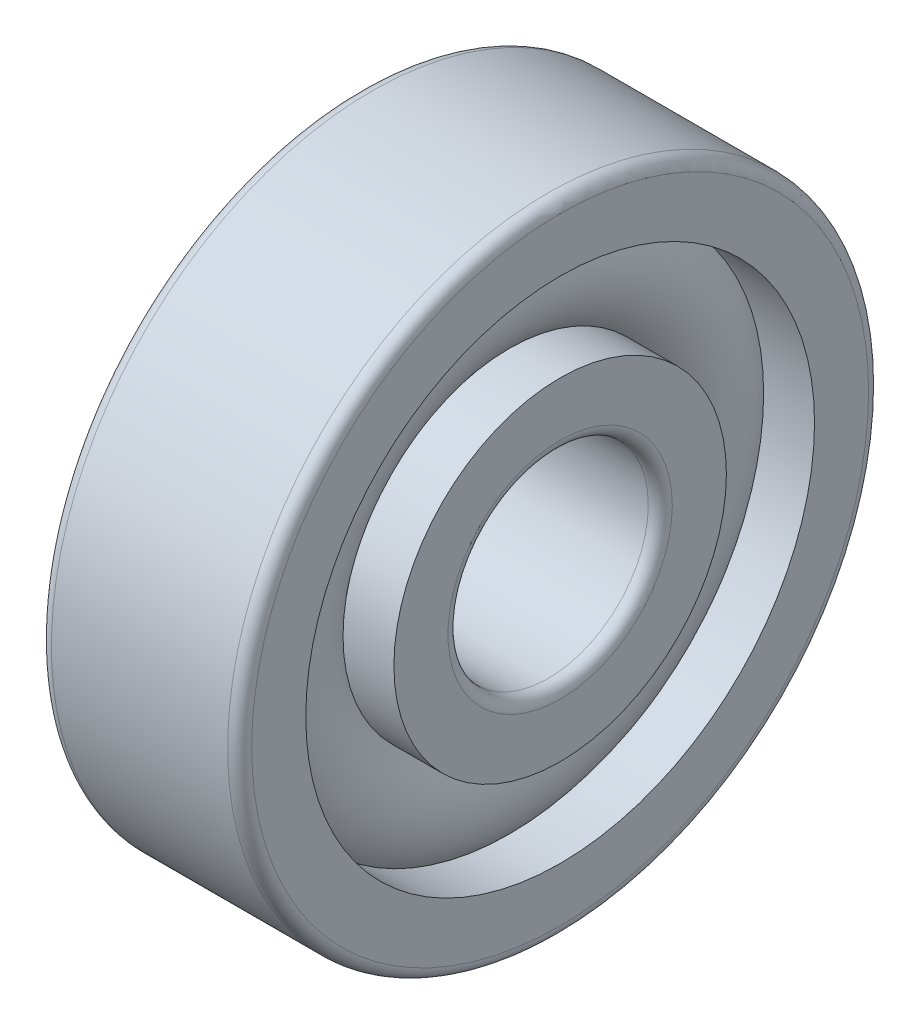
ISO-10303-21;
HEADER;
FILE_DESCRIPTION(('STEP AP214'),'2;1');
FILE_NAME('part.step','',(''),(''),'','','');
FILE_SCHEMA(('AUTOMOTIVE_DESIGN { 1 0 10303 214 1 1 1 1 }'));
ENDSEC;
DATA;
#1=APPLICATION_CONTEXT('core data for automotive mechanical design processes');
#2=APPLICATION_PROTOCOL_DEFINITION('international standard','automotive_design',2000,#1);
#3=PRODUCT_CONTEXT('',#1,'mechanical');
#4=PRODUCT('Part','Part','',(#3));
#5=PRODUCT_RELATED_PRODUCT_CATEGORY('part','',(#4));
#6=PRODUCT_DEFINITION_FORMATION('','',#4);
#7=PRODUCT_DEFINITION_CONTEXT('part definition',#1,'design');
#8=PRODUCT_DEFINITION('design','',#6,#7);
#9=PRODUCT_DEFINITION_SHAPE('','',#8);
#10=(LENGTH_UNIT() NAMED_UNIT(*) SI_UNIT(.MILLI.,.METRE.));
#11=(NAMED_UNIT(*) PLANE_ANGLE_UNIT() SI_UNIT($,.RADIAN.));
#12=(NAMED_UNIT(*) SI_UNIT($,.STERADIAN.) SOLID_ANGLE_UNIT());
#13=UNCERTAINTY_MEASURE_WITH_UNIT(LENGTH_MEASURE(1.E-05),#10,'distance_accuracy_value','');
#14=(GEOMETRIC_REPRESENTATION_CONTEXT(3) GLOBAL_UNCERTAINTY_ASSIGNED_CONTEXT((#13)) GLOBAL_UNIT_ASSIGNED_CONTEXT((#10,
#11,#12)) REPRESENTATION_CONTEXT('',''));
#15=CARTESIAN_POINT('',(0.,0.,0.));
#16=DIRECTION('',(0.,0.,1.));
#17=DIRECTION('',(1.,0.,0.));
#18=AXIS2_PLACEMENT_3D('',#15,#16,#17);
#19=CARTESIAN_POINT('',(0.,0.,0.));
#20=DIRECTION('',(-1.,0.,0.));
#21=DIRECTION('',(0.,0.,1.));
#22=AXIS2_PLACEMENT_3D('',#19,#20,#21);
#23=TOROIDAL_SURFACE('',#22,5.25,1.65);
#24=CARTESIAN_POINT('',(1.22983738762488,0.,0.));
#25=DIRECTION('',(-1.,0.,0.));
#26=DIRECTION('',(0.,0.,1.));
#27=AXIS2_PLACEMENT_3D('',#24,#25,#26);
#28=CIRCLE('',#27,6.35);
#29=CARTESIAN_POINT('',(1.22983738762488,0.,6.35));
#30=VERTEX_POINT('',#29);
#31=EDGE_CURVE('E35',#30,#30,#28,.F.);
#32=ORIENTED_EDGE('',*,*,#31,.T.);
#33=EDGE_LOOP('',(#32));
#34=FACE_BOUND('',#33,.T.);
#35=CARTESIAN_POINT('',(1.22983738762488,0.,0.));
#36=DIRECTION('',(-1.,0.,0.));
#37=DIRECTION('',(0.,0.,1.));
#38=AXIS2_PLACEMENT_3D('',#35,#36,#37);
#39=CIRCLE('',#38,4.15);
#40=CARTESIAN_POINT('',(1.22983738762488,0.,4.15));
#41=VERTEX_POINT('',#40);
#42=EDGE_CURVE('E10',#41,#41,#39,.T.);
#43=ORIENTED_EDGE('',*,*,#42,.T.);
#44=EDGE_LOOP('',(#43));
#45=FACE_BOUND('',#44,.T.);
#46=ADVANCED_FACE('F31',(#34,#45),#23,.T.);
#47=CARTESIAN_POINT('',(-20.6375,0.,0.));
#48=DIRECTION('',(1.,0.,0.));
#49=DIRECTION('',(0.,0.,-1.));
#50=AXIS2_PLACEMENT_3D('',#47,#48,#49);
#51=CYLINDRICAL_SURFACE('',#50,4.15);
#52=CARTESIAN_POINT('',(2.5,0.,0.));
#53=DIRECTION('',(1.,0.,0.));
#54=DIRECTION('',(0.,0.,-1.));
#55=AXIS2_PLACEMENT_3D('',#52,#53,#54);
#56=CIRCLE('',#55,4.15);
#57=CARTESIAN_POINT('',(2.5,0.,-4.15));
#58=VERTEX_POINT('',#57);
#59=EDGE_CURVE('E44',#58,#58,#56,.T.);
#60=ORIENTED_EDGE('',*,*,#59,.F.);
#61=EDGE_LOOP('',(#60));
#62=FACE_BOUND('',#61,.T.);
#63=ORIENTED_EDGE('',*,*,#42,.F.);
#64=EDGE_LOOP('',(#63));
#65=FACE_BOUND('',#64,.T.);
#66=ADVANCED_FACE('F83',(#62,#65),#51,.T.);
#67=CARTESIAN_POINT('',(-20.6375,0.,0.));
#68=DIRECTION('',(1.,0.,0.));
#69=DIRECTION('',(0.,0.,-1.));
#70=AXIS2_PLACEMENT_3D('',#67,#68,#69);
#71=CYLINDRICAL_SURFACE('',#70,4.15);
#72=CARTESIAN_POINT('',(-2.5,0.,0.));
#73=DIRECTION('',(1.,0.,0.));
#74=DIRECTION('',(0.,0.,-1.));
#75=AXIS2_PLACEMENT_3D('',#72,#73,#74);
#76=CIRCLE('',#75,4.15);
#77=CARTESIAN_POINT('',(-2.5,0.,-4.15));
#78=VERTEX_POINT('',#77);
#79=EDGE_CURVE('E53',#78,#78,#76,.T.);
#80=ORIENTED_EDGE('',*,*,#79,.T.);
#81=EDGE_LOOP('',(#80));
#82=FACE_BOUND('',#81,.T.);
#83=CARTESIAN_POINT('',(-1.22983738762488,0.,0.));
#84=DIRECTION('',(1.,0.,0.));
#85=DIRECTION('',(0.,0.,-1.));
#86=AXIS2_PLACEMENT_3D('',#83,#84,#85);
#87=CIRCLE('',#86,4.15);
#88=CARTESIAN_POINT('',(-1.22983738762488,0.,-4.15));
#89=VERTEX_POINT('',#88);
#90=EDGE_CURVE('E39',#89,#89,#87,.T.);
#91=ORIENTED_EDGE('',*,*,#90,.F.);
#92=EDGE_LOOP('',(#91));
#93=FACE_BOUND('',#92,.T.);
#94=ADVANCED_FACE('F86',(#82,#93),#71,.T.);
#95=CARTESIAN_POINT('',(2.5,2.8,0.));
#96=DIRECTION('',(1.,0.,0.));
#97=DIRECTION('',(0.,0.,-1.));
#98=AXIS2_PLACEMENT_3D('',#95,#96,#97);
#99=PLANE('',#98);
#100=ORIENTED_EDGE('',*,*,#59,.T.);
#101=EDGE_LOOP('',(#100));
#102=FACE_BOUND('',#101,.T.);
#103=CARTESIAN_POINT('',(2.5,0.,0.));
#104=DIRECTION('',(1.,0.,0.));
#105=DIRECTION('',(0.,0.,-1.));
#106=AXIS2_PLACEMENT_3D('',#103,#104,#105);
#107=CIRCLE('',#106,2.8);
#108=CARTESIAN_POINT('',(2.5,0.,-2.8));
#109=VERTEX_POINT('',#108);
#110=EDGE_CURVE('E75',#109,#109,#107,.T.);
#111=ORIENTED_EDGE('',*,*,#110,.F.);
#112=EDGE_LOOP('',(#111));
#113=FACE_BOUND('',#112,.T.);
#114=ADVANCED_FACE('F80',(#102,#113),#99,.T.);
#115=CARTESIAN_POINT('',(2.2,0.,0.));
#116=DIRECTION('',(1.,0.,0.));
#117=DIRECTION('',(0.,0.,-1.));
#118=AXIS2_PLACEMENT_3D('',#115,#116,#117);
#119=TOROIDAL_SURFACE('',#118,2.8,0.3);
#120=ORIENTED_EDGE('',*,*,#110,.T.);
#121=EDGE_LOOP('',(#120));
#122=FACE_BOUND('',#121,.T.);
#123=CARTESIAN_POINT('',(2.2,0.,0.));
#124=DIRECTION('',(1.,0.,0.));
#125=DIRECTION('',(0.,0.,-1.));
#126=AXIS2_PLACEMENT_3D('',#123,#124,#125);
#127=CIRCLE('',#126,2.5);
#128=CARTESIAN_POINT('',(2.2,0.,-2.5));
#129=VERTEX_POINT('',#128);
#130=EDGE_CURVE('E72',#129,#129,#127,.T.);
#131=ORIENTED_EDGE('',*,*,#130,.F.);
#132=EDGE_LOOP('',(#131));
#133=FACE_BOUND('',#132,.T.);
#134=ADVANCED_FACE('F97',(#122,#133),#119,.T.);
#135=CARTESIAN_POINT('',(-20.6375,0.,0.));
#136=DIRECTION('',(1.,0.,0.));
#137=DIRECTION('',(0.,0.,-1.));
#138=AXIS2_PLACEMENT_3D('',#135,#136,#137);
#139=CYLINDRICAL_SURFACE('',#138,2.5);
#140=ORIENTED_EDGE('',*,*,#130,.T.);
#141=EDGE_LOOP('',(#140));
#142=FACE_BOUND('',#141,.T.);
#143=CARTESIAN_POINT('',(-2.2,0.,0.));
#144=DIRECTION('',(1.,0.,0.));
#145=DIRECTION('',(0.,0.,-1.));
#146=AXIS2_PLACEMENT_3D('',#143,#144,#145);
#147=CIRCLE('',#146,2.5);
#148=CARTESIAN_POINT('',(-2.2,0.,-2.5));
#149=VERTEX_POINT('',#148);
#150=EDGE_CURVE('E69',#149,#149,#147,.T.);
#151=ORIENTED_EDGE('',*,*,#150,.F.);
#152=EDGE_LOOP('',(#151));
#153=FACE_BOUND('',#152,.T.);
#154=ADVANCED_FACE('F100',(#142,#153),#139,.F.);
#155=CARTESIAN_POINT('',(-2.2,0.,0.));
#156=DIRECTION('',(1.,0.,0.));
#157=DIRECTION('',(0.,0.,-1.));
#158=AXIS2_PLACEMENT_3D('',#155,#156,#157);
#159=TOROIDAL_SURFACE('',#158,2.8,0.3);
#160=ORIENTED_EDGE('',*,*,#150,.T.);
#161=EDGE_LOOP('',(#160));
#162=FACE_BOUND('',#161,.T.);
#163=CARTESIAN_POINT('',(-2.5,0.,0.));
#164=DIRECTION('',(1.,0.,0.));
#165=DIRECTION('',(0.,0.,-1.));
#166=AXIS2_PLACEMENT_3D('',#163,#164,#165);
#167=CIRCLE('',#166,2.8);
#168=CARTESIAN_POINT('',(-2.5,0.,-2.8));
#169=VERTEX_POINT('',#168);
#170=EDGE_CURVE('E66',#169,#169,#167,.T.);
#171=ORIENTED_EDGE('',*,*,#170,.F.);
#172=EDGE_LOOP('',(#171));
#173=FACE_BOUND('',#172,.T.);
#174=ADVANCED_FACE('F104',(#162,#173),#159,.T.);
#175=CARTESIAN_POINT('',(-2.5,4.15,0.));
#176=DIRECTION('',(-1.,0.,0.));
#177=DIRECTION('',(0.,0.,1.));
#178=AXIS2_PLACEMENT_3D('',#175,#176,#177);
#179=PLANE('',#178);
#180=ORIENTED_EDGE('',*,*,#170,.T.);
#181=EDGE_LOOP('',(#180));
#182=FACE_BOUND('',#181,.T.);
#183=ORIENTED_EDGE('',*,*,#79,.F.);
#184=EDGE_LOOP('',(#183));
#185=FACE_BOUND('',#184,.T.);
#186=ADVANCED_FACE('F108',(#182,#185),#179,.T.);
#187=CARTESIAN_POINT('',(-1.22983738762488,0.,0.));
#188=DIRECTION('',(1.,0.,0.));
#189=DIRECTION('',(0.,0.,-1.));
#190=AXIS2_PLACEMENT_3D('',#187,#188,#189);
#191=CIRCLE('',#190,6.35);
#192=CARTESIAN_POINT('',(-1.22983738762488,0.,-6.35));
#193=VERTEX_POINT('',#192);
#194=EDGE_CURVE('E47',#193,#193,#191,.F.);
#195=ORIENTED_EDGE('',*,*,#194,.T.);
#196=EDGE_LOOP('',(#195));
#197=FACE_BOUND('',#196,.T.);
#198=ORIENTED_EDGE('',*,*,#90,.T.);
#199=EDGE_LOOP('',(#198));
#200=FACE_BOUND('',#199,.T.);
#201=ADVANCED_FACE('F33',(#197,#200),#23,.T.);
#202=CARTESIAN_POINT('',(-20.6375,0.,0.));
#203=DIRECTION('',(1.,0.,0.));
#204=DIRECTION('',(0.,0.,-1.));
#205=AXIS2_PLACEMENT_3D('',#202,#203,#204);
#206=CYLINDRICAL_SURFACE('',#205,6.35);
#207=CARTESIAN_POINT('',(2.5,0.,0.));
#208=DIRECTION('',(1.,0.,0.));
#209=DIRECTION('',(0.,0.,-1.));
#210=AXIS2_PLACEMENT_3D('',#207,#208,#209);
#211=CIRCLE('',#210,6.35);
#212=CARTESIAN_POINT('',(2.5,0.,-6.35));
#213=VERTEX_POINT('',#212);
#214=EDGE_CURVE('E49',#213,#213,#211,.T.);
#215=ORIENTED_EDGE('',*,*,#214,.T.);
#216=EDGE_LOOP('',(#215));
#217=FACE_BOUND('',#216,.T.);
#218=ORIENTED_EDGE('',*,*,#31,.F.);
#219=EDGE_LOOP('',(#218));
#220=FACE_BOUND('',#219,.T.);
#221=ADVANCED_FACE('F113',(#217,#220),#206,.F.);
#222=CARTESIAN_POINT('',(-20.6375,0.,0.));
#223=DIRECTION('',(1.,0.,0.));
#224=DIRECTION('',(0.,0.,-1.));
#225=AXIS2_PLACEMENT_3D('',#222,#223,#224);
#226=CYLINDRICAL_SURFACE('',#225,6.35);
#227=CARTESIAN_POINT('',(-2.5,0.,0.));
#228=DIRECTION('',(1.,0.,0.));
#229=DIRECTION('',(0.,0.,-1.));
#230=AXIS2_PLACEMENT_3D('',#227,#228,#229);
#231=CIRCLE('',#230,6.35);
#232=CARTESIAN_POINT('',(-2.5,0.,-6.35));
#233=VERTEX_POINT('',#232);
#234=EDGE_CURVE('E144',#233,#233,#231,.T.);
#235=ORIENTED_EDGE('',*,*,#234,.F.);
#236=EDGE_LOOP('',(#235));
#237=FACE_BOUND('',#236,.T.);
#238=ORIENTED_EDGE('',*,*,#194,.F.);
#239=EDGE_LOOP('',(#238));
#240=FACE_BOUND('',#239,.T.);
#241=ADVANCED_FACE('F116',(#237,#240),#226,.F.);
#242=CARTESIAN_POINT('',(2.5,7.70000000000001,0.));
#243=DIRECTION('',(1.,0.,0.));
#244=DIRECTION('',(0.,0.,-1.));
#245=AXIS2_PLACEMENT_3D('',#242,#243,#244);
#246=PLANE('',#245);
#247=CARTESIAN_POINT('',(2.5,0.,0.));
#248=DIRECTION('',(1.,0.,0.));
#249=DIRECTION('',(0.,0.,-1.));
#250=AXIS2_PLACEMENT_3D('',#247,#248,#249);
#251=CIRCLE('',#250,7.70000000000001);
#252=CARTESIAN_POINT('',(2.5,0.,-7.70000000000001));
#253=VERTEX_POINT('',#252);
#254=EDGE_CURVE('E55',#253,#253,#251,.T.);
#255=ORIENTED_EDGE('',*,*,#254,.T.);
#256=EDGE_LOOP('',(#255));
#257=FACE_BOUND('',#256,.T.);
#258=ORIENTED_EDGE('',*,*,#214,.F.);
#259=EDGE_LOOP('',(#258));
#260=FACE_BOUND('',#259,.T.);
#261=ADVANCED_FACE('F117',(#257,#260),#246,.T.);
#262=CARTESIAN_POINT('',(2.2,0.,0.));
#263=DIRECTION('',(1.,0.,0.));
#264=DIRECTION('',(0.,0.,-1.));
#265=AXIS2_PLACEMENT_3D('',#262,#263,#264);
#266=TOROIDAL_SURFACE('',#265,7.70000000000001,0.299999999999999);
#267=CARTESIAN_POINT('',(2.2,0.,0.));
#268=DIRECTION('',(1.,0.,0.));
#269=DIRECTION('',(0.,0.,-1.));
#270=AXIS2_PLACEMENT_3D('',#267,#268,#269);
#271=CIRCLE('',#270,8.00000000000001);
#272=CARTESIAN_POINT('',(2.2,0.,-8.00000000000001));
#273=VERTEX_POINT('',#272);
#274=EDGE_CURVE('E60',#273,#273,#271,.T.);
#275=ORIENTED_EDGE('',*,*,#274,.T.);
#276=EDGE_LOOP('',(#275));
#277=FACE_BOUND('',#276,.T.);
#278=ORIENTED_EDGE('',*,*,#254,.F.);
#279=EDGE_LOOP('',(#278));
#280=FACE_BOUND('',#279,.T.);
#281=ADVANCED_FACE('F120',(#277,#280),#266,.T.);
#282=CARTESIAN_POINT('',(-20.6375,0.,0.));
#283=DIRECTION('',(1.,0.,0.));
#284=DIRECTION('',(0.,0.,-1.));
#285=AXIS2_PLACEMENT_3D('',#282,#283,#284);
#286=CYLINDRICAL_SURFACE('',#285,8.00000000000001);
#287=CARTESIAN_POINT('',(-2.2,0.,0.));
#288=DIRECTION('',(1.,0.,0.));
#289=DIRECTION('',(0.,0.,-1.));
#290=AXIS2_PLACEMENT_3D('',#287,#288,#289);
#291=CIRCLE('',#290,8.00000000000001);
#292=CARTESIAN_POINT('',(-2.2,0.,-8.00000000000001));
#293=VERTEX_POINT('',#292);
#294=EDGE_CURVE('E148',#293,#293,#291,.T.);
#295=ORIENTED_EDGE('',*,*,#294,.T.);
#296=EDGE_LOOP('',(#295));
#297=FACE_BOUND('',#296,.T.);
#298=ORIENTED_EDGE('',*,*,#274,.F.);
#299=EDGE_LOOP('',(#298));
#300=FACE_BOUND('',#299,.T.);
#301=ADVANCED_FACE('F124',(#297,#300),#286,.T.);
#302=CARTESIAN_POINT('',(-2.2,0.,0.));
#303=DIRECTION('',(1.,0.,0.));
#304=DIRECTION('',(0.,0.,-1.));
#305=AXIS2_PLACEMENT_3D('',#302,#303,#304);
#306=TOROIDAL_SURFACE('',#305,7.70000000000001,0.299999999999999);
#307=CARTESIAN_POINT('',(-2.5,0.,0.));
#308=DIRECTION('',(1.,0.,0.));
#309=DIRECTION('',(0.,0.,-1.));
#310=AXIS2_PLACEMENT_3D('',#307,#308,#309);
#311=CIRCLE('',#310,7.70000000000001);
#312=CARTESIAN_POINT('',(-2.5,0.,-7.70000000000001));
#313=VERTEX_POINT('',#312);
#314=EDGE_CURVE('E145',#313,#313,#311,.T.);
#315=ORIENTED_EDGE('',*,*,#314,.T.);
#316=EDGE_LOOP('',(#315));
#317=FACE_BOUND('',#316,.T.);
#318=ORIENTED_EDGE('',*,*,#294,.F.);
#319=EDGE_LOOP('',(#318));
#320=FACE_BOUND('',#319,.T.);
#321=ADVANCED_FACE('F128',(#317,#320),#306,.T.);
#322=CARTESIAN_POINT('',(-2.5,6.35,0.));
#323=DIRECTION('',(-1.,0.,0.));
#324=DIRECTION('',(0.,0.,1.));
#325=AXIS2_PLACEMENT_3D('',#322,#323,#324);
#326=PLANE('',#325);
#327=ORIENTED_EDGE('',*,*,#234,.T.);
#328=EDGE_LOOP('',(#327));
#329=FACE_BOUND('',#328,.T.);
#330=ORIENTED_EDGE('',*,*,#314,.F.);
#331=EDGE_LOOP('',(#330));
#332=FACE_BOUND('',#331,.T.);
#333=ADVANCED_FACE('F132',(#329,#332),#326,.T.);
#334=CLOSED_SHELL('',(#46,#66,#94,#114,#134,#154,#174,#186,#201,#221,#241,#261,#281,#301,#321,#333));
#335=MANIFOLD_SOLID_BREP('B2',#334);
#336=ADVANCED_BREP_SHAPE_REPRESENTATION('',(#18,#335),#14);
#337=SHAPE_DEFINITION_REPRESENTATION(#9,#336);
ENDSEC;
END-ISO-10303-21;
